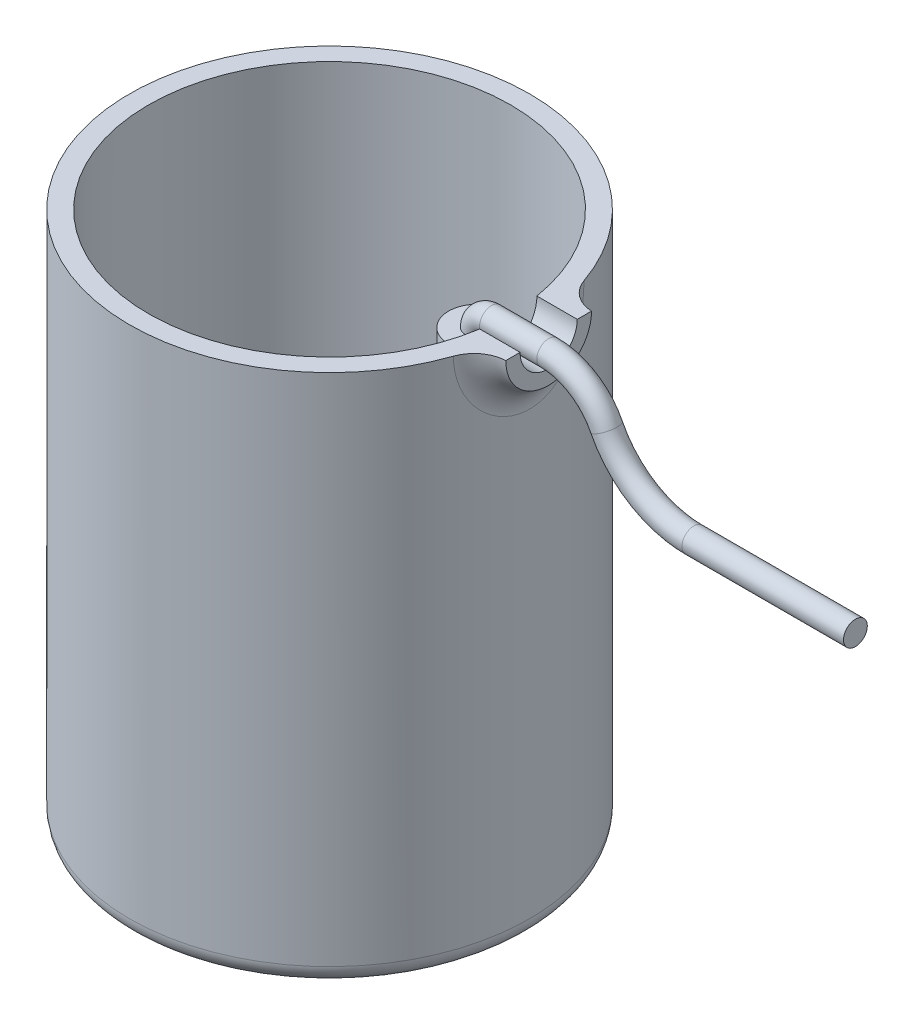
ISO-10303-21;
HEADER;
FILE_DESCRIPTION(('STEP AP214'),'2;1');
FILE_NAME('part.step','',(''),(''),'','','');
FILE_SCHEMA(('AUTOMOTIVE_DESIGN { 1 0 10303 214 1 1 1 1 }'));
ENDSEC;
DATA;
#1=APPLICATION_CONTEXT('core data for automotive mechanical design processes');
#2=APPLICATION_PROTOCOL_DEFINITION('international standard','automotive_design',2000,#1);
#3=PRODUCT_CONTEXT('',#1,'mechanical');
#4=PRODUCT('Part','Part','',(#3));
#5=PRODUCT_RELATED_PRODUCT_CATEGORY('part','',(#4));
#6=PRODUCT_DEFINITION_FORMATION('','',#4);
#7=PRODUCT_DEFINITION_CONTEXT('part definition',#1,'design');
#8=PRODUCT_DEFINITION('design','',#6,#7);
#9=PRODUCT_DEFINITION_SHAPE('','',#8);
#10=(LENGTH_UNIT() NAMED_UNIT(*) SI_UNIT(.MILLI.,.METRE.));
#11=(NAMED_UNIT(*) PLANE_ANGLE_UNIT() SI_UNIT($,.RADIAN.));
#12=(NAMED_UNIT(*) SI_UNIT($,.STERADIAN.) SOLID_ANGLE_UNIT());
#13=UNCERTAINTY_MEASURE_WITH_UNIT(LENGTH_MEASURE(1.E-05),#10,'distance_accuracy_value','');
#14=(GEOMETRIC_REPRESENTATION_CONTEXT(3) GLOBAL_UNCERTAINTY_ASSIGNED_CONTEXT((#13)) GLOBAL_UNIT_ASSIGNED_CONTEXT((#10,
#11,#12)) REPRESENTATION_CONTEXT('',''));
#15=CARTESIAN_POINT('',(0.,0.,0.));
#16=DIRECTION('',(0.,0.,1.));
#17=DIRECTION('',(1.,0.,0.));
#18=AXIS2_PLACEMENT_3D('',#15,#16,#17);
#19=CARTESIAN_POINT('',(0.,0.,0.));
#20=DIRECTION('',(0.,-1.,0.));
#21=DIRECTION('',(0.,0.,-1.));
#22=AXIS2_PLACEMENT_3D('',#19,#20,#21);
#23=CYLINDRICAL_SURFACE('',#22,21.);
#24=CARTESIAN_POINT('',(0.,2.,0.));
#25=DIRECTION('',(0.,-1.,0.));
#26=DIRECTION('',(0.,0.,-1.));
#27=AXIS2_PLACEMENT_3D('',#24,#25,#26);
#28=CIRCLE('',#27,21.);
#29=CARTESIAN_POINT('',(0.,2.,-21.));
#30=VERTEX_POINT('',#29);
#31=EDGE_CURVE('E120',#30,#30,#28,.F.);
#32=ORIENTED_EDGE('',*,*,#31,.T.);
#33=EDGE_LOOP('',(#32));
#34=FACE_BOUND('',#33,.T.);
#35=CARTESIAN_POINT('',(0.,56.,0.));
#36=DIRECTION('',(0.,-1.,0.));
#37=DIRECTION('',(0.,0.,-1.));
#38=AXIS2_PLACEMENT_3D('',#35,#36,#37);
#39=CIRCLE('',#38,21.);
#40=CARTESIAN_POINT('',(19.8499796078561,56.,6.85407248048206));
#41=VERTEX_POINT('',#40);
#42=CARTESIAN_POINT('',(19.8499796078561,56.,-6.854072480482));
#43=VERTEX_POINT('',#42);
#44=EDGE_CURVE('E110',#41,#43,#39,.T.);
#45=ORIENTED_EDGE('',*,*,#44,.T.);
#46=CARTESIAN_POINT('',(23.,58.2430537271344,3.90111650392407));
#47=CARTESIAN_POINT('',(20.7077864451711,58.7190716469949,4.01477908529431));
#48=CARTESIAN_POINT('',(20.1491447914273,59.9692255018648,5.91709085396675));
#49=CARTESIAN_POINT('',(23.,58.1402196181122,3.96025039395314));
#50=CARTESIAN_POINT('',(20.699960827176,58.5939635923719,4.07396738772159));
#51=CARTESIAN_POINT('',(20.1217707549883,59.7895840556157,6.0102744752983));
#52=CARTESIAN_POINT('',(23.,58.0350117850355,4.01532489795576));
#53=CARTESIAN_POINT('',(20.6925886550627,58.4660653326959,4.128900590115));
#54=CARTESIAN_POINT('',(20.0956272406185,59.6050949216455,6.09693835125919));
#55=CARTESIAN_POINT('',(23.,57.820455858703,4.11704064037203));
#56=CARTESIAN_POINT('',(20.6788529959362,58.2053402284517,4.23011824678415));
#57=CARTESIAN_POINT('',(20.0464448745531,59.2277917010188,6.25676742039932));
#58=CARTESIAN_POINT('',(23.,57.7111079244772,4.16368220231623));
#59=CARTESIAN_POINT('',(20.6724909470143,58.0725241354584,4.27639126825835));
#60=CARTESIAN_POINT('',(20.0234059037601,59.0349779340894,6.32993313143902));
#61=CARTESIAN_POINT('',(23.,57.4889696139641,4.24818463978836));
#62=CARTESIAN_POINT('',(20.6608913014349,57.8028593219275,4.36004727463155));
#63=CARTESIAN_POINT('',(19.9810928281289,58.6425560839005,6.46225515785594));
#64=CARTESIAN_POINT('',(23.,57.3761823788835,4.28605327122479));
#65=CARTESIAN_POINT('',(20.6556540720805,57.6660274374359,4.39742782519644));
#66=CARTESIAN_POINT('',(19.9618154002103,58.4429541822929,6.52142384860222));
#67=CARTESIAN_POINT('',(23.,57.1478049019924,4.35278277332633));
#68=CARTESIAN_POINT('',(20.6463827469605,57.3891159506213,4.46317931697273));
#69=CARTESIAN_POINT('',(19.9275079201361,58.0383375466153,6.62551058674562));
#70=CARTESIAN_POINT('',(23.,57.0322147461829,4.38164391998856));
#71=CARTESIAN_POINT('',(20.6423497886516,57.2490522469043,4.4915419713585));
#72=CARTESIAN_POINT('',(19.9124777378427,57.833322978603,6.6704290707821));
#73=CARTESIAN_POINT('',(23.,56.6856571235788,4.45363474283271));
#74=CARTESIAN_POINT('',(20.6322606467493,56.8292536508825,4.56222178811141));
#75=CARTESIAN_POINT('',(19.874770020463,57.2182985029501,6.78233146632502));
#76=CARTESIAN_POINT('',(23.,56.4514803462469,4.48346940859559));
#77=CARTESIAN_POINT('',(20.6280422984199,56.546009946086,4.59134788687038));
#78=CARTESIAN_POINT('',(19.8588061561282,56.8022490943829,6.82848618745863));
#79=CARTESIAN_POINT('',(23.,55.9813100598249,4.50611859298195));
#80=CARTESIAN_POINT('',(20.6248411348806,55.9773503519291,4.61348438890996));
#81=CARTESIAN_POINT('',(19.8467130598608,55.9667972936325,6.86354594123548));
#82=CARTESIAN_POINT('',(23.,55.7453169202398,4.49894045227436));
#83=CARTESIAN_POINT('',(20.6258590824167,55.6920946832333,4.60648951533922));
#84=CARTESIAN_POINT('',(19.8505798949482,55.5473955827772,6.85246232583209));
#85=CARTESIAN_POINT('',(23.,55.2777182819654,4.44787684659808));
#86=CARTESIAN_POINT('',(20.6330610908462,55.1263481608323,4.55652765267304));
#87=CARTESIAN_POINT('',(19.8777174499586,54.7167267959534,6.7733363689783));
#88=CARTESIAN_POINT('',(23.,55.0461133288163,4.40398684783002));
#89=CARTESIAN_POINT('',(20.6392418098724,54.8460121430399,4.51358388188284));
#90=CARTESIAN_POINT('',(19.9009905664953,54.3054607311335,6.70528699243414));
#91=CARTESIAN_POINT('',(23.,54.5933161997628,4.28092576302448));
#92=CARTESIAN_POINT('',(20.6563802291353,54.2971431472283,4.39244129628761));
#93=CARTESIAN_POINT('',(19.9645833919613,53.5028457806394,6.51348802427669));
#94=CARTESIAN_POINT('',(23.,54.3721251814166,4.2017507650808));
#95=CARTESIAN_POINT('',(20.66732986279,54.0287369666535,4.31430068856788));
#96=CARTESIAN_POINT('',(20.0049049909619,53.1114991087099,6.38973225670421));
#97=CARTESIAN_POINT('',(23.,53.9454370929978,4.01041413793367));
#98=CARTESIAN_POINT('',(20.6932956933603,53.5103581980699,4.12416508480508));
#99=CARTESIAN_POINT('',(20.0983782218066,52.360111567259,6.08931721705554));
#100=CARTESIAN_POINT('',(23.,53.7399287752306,3.89827643517762));
#101=CARTESIAN_POINT('',(20.7082978045027,53.260458596198,4.01228175367286));
#102=CARTESIAN_POINT('',(20.1515205425492,52.0000482350338,5.91269631619556));
#103=CARTESIAN_POINT('',(23.,53.348717231057,3.64351393206175));
#104=CARTESIAN_POINT('',(20.7413750441667,52.7846382692711,3.75643455120674));
#105=CARTESIAN_POINT('',(20.2650728454456,51.3208030925135,5.51091865375543));
#106=CARTESIAN_POINT('',(23.,53.1630098932833,3.50089547910738));
#107=CARTESIAN_POINT('',(20.7594381050177,52.558757060328,3.61258036468647));
#108=CARTESIAN_POINT('',(20.3254813133313,51.0016127927888,5.28577199724589));
#109=CARTESIAN_POINT('',(23.,52.8140478276441,3.18671757703731));
#110=CARTESIAN_POINT('',(20.7974163739112,52.1347370435086,3.29389462108461));
#111=CARTESIAN_POINT('',(20.4476573817046,50.410073533923,4.79148762003156));
#112=CARTESIAN_POINT('',(23.,52.6509386183428,3.01498508326401));
#113=CARTESIAN_POINT('',(20.8173336010592,51.9367732780899,3.11898313578324));
#114=CARTESIAN_POINT('',(20.5094310662796,50.1380255652803,4.52208718498042));
#115=CARTESIAN_POINT('',(23.,52.3523019850106,2.64587685905357));
#116=CARTESIAN_POINT('',(20.8571056061121,51.5750899733154,2.74131419252225));
#117=CARTESIAN_POINT('',(20.6276798496163,49.6485874824216,3.94774783979976));
#118=CARTESIAN_POINT('',(23.,52.2167941464121,2.44848308141868));
#119=CARTESIAN_POINT('',(20.8769583735801,51.411335900443,2.538620427649));
#120=CARTESIAN_POINT('',(20.6841511707071,49.4312361543769,3.64278393410216));
#121=CARTESIAN_POINT('',(23.,51.9736751219931,2.02491519533356));
#122=CARTESIAN_POINT('',(20.9148838063365,51.1183625039794,2.10219763617807));
#123=CARTESIAN_POINT('',(20.7879232576544,49.0482968259581,2.99552569937812));
#124=CARTESIAN_POINT('',(23.,51.8671331565807,1.79800584355142));
#125=CARTESIAN_POINT('',(20.9328868476712,50.9903285465868,1.86766467527896));
#126=CARTESIAN_POINT('',(20.8348595258176,48.8846556181867,2.65233107608471));
#127=CARTESIAN_POINT('',(23.,51.6927291540147,1.32674641484373));
#128=CARTESIAN_POINT('',(20.9635245330463,50.7813332311744,1.37949688381681));
#129=CARTESIAN_POINT('',(20.9125118621304,48.6206986819982,1.94734103946291));
#130=CARTESIAN_POINT('',(23.,51.6247908942242,1.08243178604691));
#131=CARTESIAN_POINT('',(20.9761888586377,50.7001288630425,1.12579495415456));
#132=CARTESIAN_POINT('',(20.9432598849266,48.5202581220954,1.58558382936695));
#133=CARTESIAN_POINT('',(23.,51.5687538883274,0.785167349994118));
#134=CARTESIAN_POINT('',(20.9867929385108,50.6332486581184,0.816718719205613));
#135=CARTESIAN_POINT('',(20.9686941450265,48.4379767405494,1.14846809242141));
#136=CARTESIAN_POINT('',(23.,51.5604427348931,0.736714231360254));
#137=CARTESIAN_POINT('',(20.9883723733996,50.6233370496814,0.766350506994567));
#138=CARTESIAN_POINT('',(20.9724697476755,48.4257988595753,1.07731374235106));
#139=CARTESIAN_POINT('',(23.,51.5454003195381,0.639502403999762));
#140=CARTESIAN_POINT('',(20.9912425953013,50.6054031087628,0.665280880398418));
#141=CARTESIAN_POINT('',(20.9793094097851,48.4037979098955,0.934706516850487));
#142=CARTESIAN_POINT('',(23.,51.5386690119842,0.590743704141491));
#143=CARTESIAN_POINT('',(20.9925334960028,50.5973800476633,0.61457769873566));
#144=CARTESIAN_POINT('',(20.9823734897977,48.3939747731739,0.863253650103471));
#145=CARTESIAN_POINT('',(23.,51.4993601037629,0.266500502549364));
#146=CARTESIAN_POINT('',(21.0000778684083,50.5505543364071,0.277473598974685));
#147=CARTESIAN_POINT('',(21.000271628332,48.3366433075221,0.388517292184877));
#148=CARTESIAN_POINT('',(23.,51.4914544979026,-0.0132305420824088));
#149=CARTESIAN_POINT('',(21.0016494149226,50.5411430238479,-0.013868963337211));
#150=CARTESIAN_POINT('',(21.0038972136282,48.3252914164423,-0.0190346611935832));
#151=CARTESIAN_POINT('',(23.,51.5273933259894,-0.568926637889749));
#152=CARTESIAN_POINT('',(20.9946909981463,50.5839435521437,-0.591992221645163));
#153=CARTESIAN_POINT('',(20.9875025513202,48.3775063435663,-0.830876366881333));
#154=CARTESIAN_POINT('',(23.,51.5713753755302,-0.844879701939849));
#155=CARTESIAN_POINT('',(20.9861250418558,50.6363751934542,-0.879135558970664));
#156=CARTESIAN_POINT('',(20.9674194237605,48.441272387677,-1.2351545680676));
#157=CARTESIAN_POINT('',(23.,51.7080531830557,-1.38034706934117));
#158=CARTESIAN_POINT('',(20.9608607645302,50.7996641845041,-1.43507413014874));
#159=CARTESIAN_POINT('',(20.9057059195354,48.6439645721177,-2.02695763726325));
#160=CARTESIAN_POINT('',(23.,51.8006171806654,-1.63990371899816));
#161=CARTESIAN_POINT('',(20.944158827049,50.9105384682163,-1.70416561135896));
#162=CARTESIAN_POINT('',(20.8641338282422,48.7826874499377,-2.41452476610798));
#163=CARTESIAN_POINT('',(23.,52.0289541204288,-2.13423124924901));
#164=CARTESIAN_POINT('',(20.9060037577122,51.1848752836381,-2.21508374606002));
#165=CARTESIAN_POINT('',(20.7640965907372,49.134558756018,-3.16135473268947));
#166=CARTESIAN_POINT('',(23.,52.1646848317498,-2.36902605712679));
#167=CARTESIAN_POINT('',(20.884535014431,51.3484752037218,-2.45699544172153));
#168=CARTESIAN_POINT('',(20.7056479602963,49.3476344631886,-3.5206448076428));
#169=CARTESIAN_POINT('',(23.,52.4671782307686,-2.79921040357287));
#170=CARTESIAN_POINT('',(20.8412278428969,51.7140919155062,-2.89854503978659));
#171=CARTESIAN_POINT('',(20.581375862021,49.8352899629665,-4.18531628661238));
#172=CARTESIAN_POINT('',(23.,52.6324792769761,-2.99580205145492));
#173=CARTESIAN_POINT('',(20.8194337092222,51.9144310543254,-3.09943198678026));
#174=CARTESIAN_POINT('',(20.5159418242276,50.1070626834083,-4.49228108914278));
#175=CARTESIAN_POINT('',(23.,52.9924128663399,-3.35699259505796));
#176=CARTESIAN_POINT('',(20.7772185895855,52.3513974555132,-3.4669694438368));
#177=CARTESIAN_POINT('',(20.3836262211947,50.7107377324507,-5.05891431482494));
#178=CARTESIAN_POINT('',(23.,53.187041364781,-3.52159589531665));
#179=CARTESIAN_POINT('',(20.7568064142911,52.5880453841923,-3.63349389042029));
#180=CARTESIAN_POINT('',(20.3167448566517,51.0426317706537,-5.31858924910029));
#181=CARTESIAN_POINT('',(23.,53.5896307951743,-3.80759446701762));
#182=CARTESIAN_POINT('',(20.7202437432722,53.0776648003119,-3.92147201386236));
#183=CARTESIAN_POINT('',(20.193130358981,51.7379688091022,-5.76969964146656));
#184=CARTESIAN_POINT('',(23.,53.7963104498291,-3.93083838084211));
#185=CARTESIAN_POINT('',(20.7039335800025,53.3290601405065,-4.04476550615741));
#186=CARTESIAN_POINT('',(20.1360447789902,52.0987525486004,-5.96405553611615));
#187=CARTESIAN_POINT('',(23.,54.2271575258129,-4.14302024407058));
#188=CARTESIAN_POINT('',(20.6753790956784,53.8527051038432,-4.25612564624896));
#189=CARTESIAN_POINT('',(20.0342145390462,52.8555784909476,-6.29768439890945));
#190=CARTESIAN_POINT('',(23.,54.4513203131648,-4.23196724711172));
#191=CARTESIAN_POINT('',(20.6631460671958,54.1248664353467,-4.34410231753701));
#192=CARTESIAN_POINT('',(19.9894666231086,53.2516113547726,-6.43697190415442));
#193=CARTESIAN_POINT('',(23.,54.9061008485544,-4.37133508282617));
#194=CARTESIAN_POINT('',(20.6438155825137,54.6763959171989,-4.48153224089083));
#195=CARTESIAN_POINT('',(19.9180881890148,54.0570304154953,-6.65451672636407));
#196=CARTESIAN_POINT('',(23.,55.1364236042026,-4.42265089808514));
#197=CARTESIAN_POINT('',(20.6366082897622,54.9553082764888,-4.5318133570114));
#198=CARTESIAN_POINT('',(19.8910385657267,54.4658474316669,-6.73419278583286));
#199=CARTESIAN_POINT('',(23.,55.6029800106329,-4.48862828726342));
#200=CARTESIAN_POINT('',(20.6273188182151,55.5199564773833,-4.59642599262685));
#201=CARTESIAN_POINT('',(19.8561094667656,55.2944753641475,-6.83651918277932));
#202=CARTESIAN_POINT('',(23.,55.8392146459501,-4.50328371435937));
#203=CARTESIAN_POINT('',(20.6252425866498,55.8055425065914,-4.61071594551506));
#204=CARTESIAN_POINT('',(19.8482332058837,55.7142881121816,-6.85915995719246));
#205=CARTESIAN_POINT('',(23.,56.1924936013786,-4.49742720884454));
#206=CARTESIAN_POINT('',(20.626069370709,56.2327917787783,-4.60498615678929));
#207=CARTESIAN_POINT('',(19.8513501629403,56.3420568028355,-6.8500882733794));
#208=CARTESIAN_POINT('',(23.,56.309976306964,-4.490852254342));
#209=CARTESIAN_POINT('',(20.6269993398294,56.3748678690042,-4.59856588452309));
#210=CARTESIAN_POINT('',(19.8548685125941,56.5508136404277,-6.83991876040134));
#211=CARTESIAN_POINT('',(23.,56.5440086749567,-4.46854000464633));
#212=CARTESIAN_POINT('',(20.6301479951449,56.6579907903603,-4.57674439736237));
#213=CARTESIAN_POINT('',(19.8667421438505,56.9665892284786,-6.80536052799239));
#214=CARTESIAN_POINT('',(23.,56.6605583324329,-4.45280266106391));
#215=CARTESIAN_POINT('',(20.6323662537467,56.7990182962038,-4.56134615398009));
#216=CARTESIAN_POINT('',(19.8750974509987,57.1736079697522,-6.78097173346527));
#217=CARTESIAN_POINT('',(23.,56.8919862692314,-4.41227518794661));
#218=CARTESIAN_POINT('',(20.6380603876445,57.0792012189651,-4.52161697780793));
#219=CARTESIAN_POINT('',(19.8964538412496,57.5844968115868,-6.71805444784956));
#220=CARTESIAN_POINT('',(23.,57.0068633893226,-4.38747906394684));
#221=CARTESIAN_POINT('',(20.6415363356483,57.2183373457408,-4.49728548103613));
#222=CARTESIAN_POINT('',(19.9094580005136,57.7883647338329,-6.67951659382262));
#223=CARTESIAN_POINT('',(23.,57.2341626093718,-4.32904561484516));
#224=CARTESIAN_POINT('',(20.6496858452885,57.4938035853855,-4.43980395849624));
#225=CARTESIAN_POINT('',(19.9397515366175,58.19139282432,-6.58850885257542));
#226=CARTESIAN_POINT('',(23.,57.3465845587621,-4.29540774914749));
#227=CARTESIAN_POINT('',(20.6543584512886,57.6301174931816,-4.40666081126394));
#228=CARTESIAN_POINT('',(19.9570411754735,58.3905527038932,-6.53603811347819));
#229=CARTESIAN_POINT('',(23.,57.4574195129223,-4.2574556208319));
#230=CARTESIAN_POINT('',(20.6596007141805,57.7646434010658,-4.36915994244337));
#231=CARTESIAN_POINT('',(19.9762929087104,58.5866366601394,-6.47670607835557));
#232=(BOUNDED_SURFACE() B_SPLINE_SURFACE(3,2,((#46,#47,#48),(#49,#50,#51),(#52,#53,#54),(#55,
#56,#57),(#58,#59,#60),(#61,#62,#63),(#64,#65,#66),(#67,#68,#69),(#70,#71,#72),(#73,#74,#75),
(#76,#77,#78),(#79,#80,#81),(#82,#83,#84),(#85,#86,#87),(#88,#89,#90),(#91,#92,#93),(#94,#95,
#96),(#97,#98,#99),(#100,#101,#102),(#103,#104,#105),(#106,#107,#108),(#109,#110,#111),(#112,
#113,#114),(#115,#116,#117),(#118,#119,#120),(#121,#122,#123),(#124,#125,#126),(#127,#128,#129),
(#130,#131,#132),(#133,#134,#135),(#136,#137,#138),(#139,#140,#141),(#142,#143,#144),(#145,#146,
#147),(#148,#149,#150),(#151,#152,#153),(#154,#155,#156),(#157,#158,#159),(#160,#161,#162),
(#163,#164,#165),(#166,#167,#168),(#169,#170,#171),(#172,#173,#174),(#175,#176,#177),(#178,#179,
#180),(#181,#182,#183),(#184,#185,#186),(#187,#188,#189),(#190,#191,#192),(#193,#194,#195),
(#196,#197,#198),(#199,#200,#201),(#202,#203,#204),(#205,#206,#207),(#208,#209,#210),(#211,#212,
#213),(#214,#215,#216),(#217,#218,#219),(#220,#221,#222),(#223,#224,#225),(#226,#227,#228),
(#229,#230,#231)),.UNSPECIFIED.,.F.,.F.,.F.) B_SPLINE_SURFACE_WITH_KNOTS((4,2,2,2,2,2,2,2,2,2,2,
2,2,2,2,2,2,2,2,2,2,2,2,2,2,2,2,2,2,2,4),(3,3),(0.,0.636961694353386,1.27389894642835,
1.91027093230247,2.54662341727417,3.79993314360261,5.05299431331709,6.30621025500942,
7.55956517029888,8.81201255724594,10.0641993843717,11.3241079678035,12.584907468789,
13.8873497232146,15.1872113013645,15.439248639138,15.6912786960274,17.1104977347292,
18.5334892805521,19.9526412860174,21.3704091565121,22.7313582627845,24.0921198443536,
25.3796465754021,26.666833194381,27.9223148408125,29.1780069789267,29.8048022292798,
30.4316007899544,31.0588148754259,31.6860673185178),(0.,1.),
.UNSPECIFIED.) GEOMETRIC_REPRESENTATION_ITEM() RATIONAL_B_SPLINE_SURFACE(((1.,0.830893335376098,
1.),(1.,0.830549178015659,1.),(1.,0.830225751135677,1.),(1.,0.829623909157339,1.),(1.,
0.829345492332211,1.),(1.,0.82883741987927,1.),(1.,0.828607721196373,1.),(1.,0.82820036522587,
1.),(1.,0.828022706343729,1.),(1.,0.827577534227736,1.),(1.,0.827389899562165,1.),(1.,
0.827247755939217,1.),(1.,0.827293200755686,1.),(1.,0.827612494933342,1.),(1.,0.827886372505246,
1.),(1.,0.828639974284975,1.),(1.,0.829119721316502,1.),(1.,0.830256770454492,1.),(1.,
0.830913943745475,1.),(1.,0.832379639222017,1.),(1.,0.833188129892429,1.),(1.,0.834925815113029,
1.),(1.,0.835855723253183,1.),(1.,0.837761750710435,1.),(1.,0.838737902239801,1.),(1.,
0.840646585915399,1.),(1.,0.841576612475407,1.),(1.,0.843185188190249,1.),(1.,0.843864231974451,
1.),(1.,0.84443664392475,1.),(1.,0.844522103065747,1.),(1.,0.844677649105141,1.),(1.,
0.844747736447542,1.),(1.,0.845157744639957,1.),(1.,0.845244103159933,1.),(1.,0.844864840051907,
1.),(1.,0.844397750563781,1.),(1.,0.843045461651162,1.),(1.,0.842161393778705,1.),(1.,
0.840194580258959,1.),(1.,0.839112029228123,1.),(1.,0.836992095119325,1.),(1.,0.835954640569071,
1.),(1.,0.833994005944535,1.),(1.,0.833070810144109,1.),(1.,0.831440005638506,1.),(1.,
0.830723468272056,1.),(1.,0.829471825218925,1.),(1.,0.828936671655393,1.),(1.,0.828088052928473,
1.),(1.,0.827769451986036,1.),(1.,0.82735819674703,1.),(1.,0.827265580341205,1.),(1.,
0.827302247505458,1.),(1.,0.827343627063694,1.),(1.,0.827483367530061,1.),(1.,0.82758172873913,
1.),(1.,0.82783346795137,1.),(1.,0.827986882383704,1.),(1.,0.828345616602563,1.),(1.,
0.828550939562813,1.),(1.,0.828780656677998,1.))) REPRESENTATION_ITEM('') SURFACE());
#233=CARTESIAN_POINT('',(19.9762929087104,58.5866366601394,-6.47670607835557));
#234=CARTESIAN_POINT('',(19.9570411754735,58.3905527038932,-6.53603811347819));
#235=CARTESIAN_POINT('',(19.9397515366175,58.19139282432,-6.58850885257542));
#236=CARTESIAN_POINT('',(19.9094580005136,57.7883647338329,-6.67951659382262));
#237=CARTESIAN_POINT('',(19.8964538412495,57.5844968115868,-6.71805444784956));
#238=CARTESIAN_POINT('',(19.8750974509987,57.1736079697522,-6.78097173346527));
#239=CARTESIAN_POINT('',(19.8667421438505,56.9665892284786,-6.80536052799239));
#240=CARTESIAN_POINT('',(19.8548685125941,56.5508136404277,-6.83991876040134));
#241=CARTESIAN_POINT('',(19.8513501629403,56.3420568028355,-6.8500882733794));
#242=CARTESIAN_POINT('',(19.8482332058837,55.7142881121816,-6.85915995719246));
#243=CARTESIAN_POINT('',(19.8561094667656,55.2944753641475,-6.83651918277932));
#244=CARTESIAN_POINT('',(19.8910385657267,54.4658474316669,-6.73419278583286));
#245=CARTESIAN_POINT('',(19.9180881890148,54.0570304154953,-6.65451672636407));
#246=CARTESIAN_POINT('',(19.9894666231086,53.2516113547726,-6.43697190415442));
#247=CARTESIAN_POINT('',(20.0342145390462,52.8555784909476,-6.29768439890945));
#248=CARTESIAN_POINT('',(20.1360447789902,52.0987525486004,-5.96405553611615));
#249=CARTESIAN_POINT('',(20.193130358981,51.7379688091022,-5.76969964146656));
#250=CARTESIAN_POINT('',(20.3167448566517,51.0426317706537,-5.31858924910029));
#251=CARTESIAN_POINT('',(20.3836262211947,50.7107377324507,-5.05891431482494));
#252=CARTESIAN_POINT('',(20.5159418242276,50.1070626834083,-4.49228108914278));
#253=CARTESIAN_POINT('',(20.581375862021,49.8352899629665,-4.18531628661238));
#254=CARTESIAN_POINT('',(20.7056479602963,49.3476344631886,-3.5206448076428));
#255=CARTESIAN_POINT('',(20.7640965907372,49.1345587560181,-3.16135473268947));
#256=CARTESIAN_POINT('',(20.8641338282422,48.7826874499377,-2.41452476610798));
#257=CARTESIAN_POINT('',(20.9057059195354,48.6439645721177,-2.02695763726325));
#258=CARTESIAN_POINT('',(20.9674194237605,48.441272387677,-1.2351545680676));
#259=CARTESIAN_POINT('',(20.9875025513202,48.3775063435663,-0.830876366881332));
#260=CARTESIAN_POINT('',(21.0038972136282,48.3252914164423,-0.0190346611935833));
#261=CARTESIAN_POINT('',(21.000271628332,48.3366433075221,0.388517292184876));
#262=CARTESIAN_POINT('',(20.9823734897977,48.3939747731739,0.863253650103471));
#263=CARTESIAN_POINT('',(20.9793094097851,48.4037979098955,0.934706516850486));
#264=CARTESIAN_POINT('',(20.9724697476755,48.4257988595753,1.07731374235106));
#265=CARTESIAN_POINT('',(20.9686941450266,48.4379767405495,1.14846809242141));
#266=CARTESIAN_POINT('',(20.9432598849266,48.5202581220954,1.58558382936695));
#267=CARTESIAN_POINT('',(20.9125118621304,48.6206986819982,1.94734103946291));
#268=CARTESIAN_POINT('',(20.8348595258176,48.8846556181867,2.65233107608471));
#269=CARTESIAN_POINT('',(20.7879232576544,49.0482968259581,2.99552569937812));
#270=CARTESIAN_POINT('',(20.6841511707071,49.4312361543769,3.64278393410216));
#271=CARTESIAN_POINT('',(20.6276798496163,49.6485874824216,3.94774783979976));
#272=CARTESIAN_POINT('',(20.5094310662796,50.1380255652803,4.52208718498042));
#273=CARTESIAN_POINT('',(20.4476573817046,50.410073533923,4.79148762003156));
#274=CARTESIAN_POINT('',(20.3254813133313,51.0016127927888,5.28577199724589));
#275=CARTESIAN_POINT('',(20.2650728454456,51.3208030925136,5.51091865375543));
#276=CARTESIAN_POINT('',(20.1515205425492,52.0000482350338,5.91269631619556));
#277=CARTESIAN_POINT('',(20.0983782218066,52.360111567259,6.08931721705554));
#278=CARTESIAN_POINT('',(20.0049049909619,53.1114991087099,6.38973225670421));
#279=CARTESIAN_POINT('',(19.9645833919613,53.5028457806394,6.51348802427669));
#280=CARTESIAN_POINT('',(19.9009905664953,54.3054607311335,6.70528699243414));
#281=CARTESIAN_POINT('',(19.8777174499586,54.7167267959534,6.7733363689783));
#282=CARTESIAN_POINT('',(19.8505798949482,55.5473955827772,6.85246232583209));
#283=CARTESIAN_POINT('',(19.8467130598608,55.9667972936325,6.86354594123548));
#284=CARTESIAN_POINT('',(19.8588061561282,56.8022490943828,6.82848618745863));
#285=CARTESIAN_POINT('',(19.874770020463,57.2182985029501,6.78233146632502));
#286=CARTESIAN_POINT('',(19.9124777378427,57.833322978603,6.6704290707821));
#287=CARTESIAN_POINT('',(19.9275079201361,58.0383375466153,6.62551058674562));
#288=CARTESIAN_POINT('',(19.9618154002103,58.4429541822929,6.52142384860222));
#289=CARTESIAN_POINT('',(19.9810928281289,58.6425560839005,6.46225515785594));
#290=CARTESIAN_POINT('',(20.0234059037601,59.0349779340894,6.32993313143902));
#291=CARTESIAN_POINT('',(20.0464448745531,59.2277917010188,6.25676742039932));
#292=CARTESIAN_POINT('',(20.0956272406185,59.6050949216455,6.09693835125919));
#293=CARTESIAN_POINT('',(20.1217707549883,59.7895840556157,6.0102744752983));
#294=CARTESIAN_POINT('',(20.1491447914273,59.9692255018648,5.91709085396675));
#295=B_SPLINE_CURVE_WITH_KNOTS('',3,(#233,#234,#235,#236,#237,#238,#239,#240,#241,#242,#243,
#244,#245,#246,#247,#248,#249,#250,#251,#252,#253,#254,#255,#256,#257,#258,#259,#260,#261,#262,
#263,#264,#265,#266,#267,#268,#269,#270,#271,#272,#273,#274,#275,#276,#277,#278,#279,#280,#281,
#282,#283,#284,#285,#286,#287,#288,#289,#290,#291,#292,#293,#294),.UNSPECIFIED.,.F.,.F.,(4,2,2,
2,2,2,2,2,2,2,2,2,2,2,2,2,2,2,2,2,2,2,2,2,2,2,2,2,2,2,4),(0.,0.627252443091877,1.25446652856341,
1.88126508923797,2.50806033959105,3.76375247770533,5.01923412413676,6.30642074311567,
7.59394747416419,8.9547090557333,10.3156581620057,11.7334260325004,13.1525780379657,
14.5755695837886,15.9947886224904,16.2468186793798,16.4988560171533,17.7987175953032,
19.1011598497287,20.3619593507143,21.6218679341461,22.8740547612718,24.1265021482189,
25.3798570635084,26.6330730052007,27.8861341749152,29.1394439012436,29.7757963862153,
30.4121683720894,31.0491056241644,31.6860673185178),.UNSPECIFIED.);
#296=EDGE_CURVE('E124',#43,#41,#295,.T.);
#297=ORIENTED_EDGE('',*,*,#296,.T.);
#298=EDGE_LOOP('',(#45,#297));
#299=FACE_BOUND('',#298,.T.);
#300=ADVANCED_FACE('F41',(#34,#299),#23,.T.);
#301=CARTESIAN_POINT('',(0.,2.,0.));
#302=DIRECTION('',(0.,1.,0.));
#303=DIRECTION('',(0.,0.,1.));
#304=AXIS2_PLACEMENT_3D('',#301,#302,#303);
#305=PLANE('',#304);
#306=CARTESIAN_POINT('',(15.5,2.,0.));
#307=DIRECTION('',(0.,1.,0.));
#308=DIRECTION('',(0.,0.,1.));
#309=AXIS2_PLACEMENT_3D('',#306,#307,#308);
#310=CIRCLE('',#309,3.);
#311=CARTESIAN_POINT('',(15.5,2.,3.));
#312=VERTEX_POINT('',#311);
#313=EDGE_CURVE('E303',#312,#312,#310,.T.);
#314=ORIENTED_EDGE('',*,*,#313,.F.);
#315=EDGE_LOOP('',(#314));
#316=FACE_BOUND('',#315,.T.);
#317=CARTESIAN_POINT('',(0.,2.,0.));
#318=DIRECTION('',(0.,-1.,0.));
#319=DIRECTION('',(0.,0.,-1.));
#320=AXIS2_PLACEMENT_3D('',#317,#318,#319);
#321=CIRCLE('',#320,19.);
#322=CARTESIAN_POINT('',(0.,2.,-19.));
#323=VERTEX_POINT('',#322);
#324=EDGE_CURVE('E109',#323,#323,#321,.T.);
#325=ORIENTED_EDGE('',*,*,#324,.F.);
#326=EDGE_LOOP('',(#325));
#327=FACE_BOUND('',#326,.T.);
#328=ADVANCED_FACE('F139',(#316,#327),#305,.T.);
#329=CARTESIAN_POINT('',(0.,0.,0.));
#330=DIRECTION('',(0.,-1.,0.));
#331=DIRECTION('',(0.,0.,-1.));
#332=AXIS2_PLACEMENT_3D('',#329,#330,#331);
#333=CYLINDRICAL_SURFACE('',#332,19.);
#334=CARTESIAN_POINT('',(18.7616630392938,56.,3.00000000000006));
#335=CARTESIAN_POINT('',(18.761657423998,55.9161825604073,3.00000869502199));
#336=CARTESIAN_POINT('',(18.7622245982653,55.8323696771555,2.99648739376207));
#337=CARTESIAN_POINT('',(18.7644629923588,55.6653539891527,2.98245218505682));
#338=CARTESIAN_POINT('',(18.7661341076854,55.5821511274105,2.97193893947116));
#339=CARTESIAN_POINT('',(18.7705361931051,55.4170405718178,2.94400415988912));
#340=CARTESIAN_POINT('',(18.7732658749571,55.3351314291674,2.92659102227858));
#341=CARTESIAN_POINT('',(18.7797012860914,55.1731103478566,2.88500578102272));
#342=CARTESIAN_POINT('',(18.7834070132543,55.0929984052938,2.86083369205504));
#343=CARTESIAN_POINT('',(18.7958404034488,54.8561636732071,2.77840235185322));
#344=CARTESIAN_POINT('',(18.8058873473559,54.7028343969563,2.71020970070203));
#345=CARTESIAN_POINT('',(18.8283581111186,54.4098777359918,2.54940708876379));
#346=CARTESIAN_POINT('',(18.8407819114043,54.2702502384775,2.45679732901477));
#347=CARTESIAN_POINT('',(18.8667293195783,54.0073305997955,2.24890102453054));
#348=CARTESIAN_POINT('',(18.8802607659226,53.8841746927487,2.13344286443401));
#349=CARTESIAN_POINT('',(18.9068301208734,53.6588938853749,1.8834915766065));
#350=CARTESIAN_POINT('',(18.9198679537061,53.556772203378,1.74899554129953));
#351=CARTESIAN_POINT('',(18.9440630322152,53.3759533603581,1.4639051001426));
#352=CARTESIAN_POINT('',(18.9552099031092,53.2973837209021,1.31322884984651));
#353=CARTESIAN_POINT('',(18.9742785910654,53.1667245338713,1.00062131516932));
#354=CARTESIAN_POINT('',(18.9822007815931,53.1146319196928,0.83869133668041));
#355=CARTESIAN_POINT('',(18.9938725255218,53.0388183521606,0.509588402360056));
#356=CARTESIAN_POINT('',(18.9976561038329,53.0148659261869,0.342469996530485));
#357=CARTESIAN_POINT('',(19.0007411053238,52.99529346957,0.00654223245910571));
#358=CARTESIAN_POINT('',(19.0000426964357,52.9996723774024,-0.162267062191508));
#359=CARTESIAN_POINT('',(18.9942693178939,53.0364575992912,-0.495195123577505));
#360=CARTESIAN_POINT('',(18.9892333610298,53.0686140836583,-0.659342266961186));
#361=CARTESIAN_POINT('',(18.9753942524631,53.159648757764,-0.979880162242109));
#362=CARTESIAN_POINT('',(18.9665910186346,53.2185275300441,-1.13627074496512));
#363=CARTESIAN_POINT('',(18.9461395429066,53.3615888432726,-1.43760997717451));
#364=CARTESIAN_POINT('',(18.9344795785375,53.4458759833158,-1.58250813977246));
#365=CARTESIAN_POINT('',(18.9096129160728,53.6372818672341,-1.85619267268496));
#366=CARTESIAN_POINT('',(18.8964061646893,53.7444013978043,-1.98497848760226));
#367=CARTESIAN_POINT('',(18.8697482716008,53.9798037236421,-2.2242472603209));
#368=CARTESIAN_POINT('',(18.8562960297529,54.1083020463587,-2.33451813106773));
#369=CARTESIAN_POINT('',(18.8307975969792,54.3821358716989,-2.53199745921606));
#370=CARTESIAN_POINT('',(18.8187518109854,54.5274761994154,-2.61919928392261));
#371=CARTESIAN_POINT('',(18.7974283233195,54.831121155361,-2.76809987118403));
#372=CARTESIAN_POINT('',(18.7881548051623,54.9894449221699,-2.82976014356903));
#373=CARTESIAN_POINT('',(18.7734929089433,55.3142710955122,-2.92546538419847));
#374=CARTESIAN_POINT('',(18.7680987156028,55.4807608589359,-2.95955169663896));
#375=CARTESIAN_POINT('',(18.7638576155871,55.707084244195,-2.98624689727119));
#376=CARTESIAN_POINT('',(18.763035347921,55.7655973407484,-2.99140653790588));
#377=CARTESIAN_POINT('',(18.7619386344572,55.8827318227603,-2.99827856784788));
#378=CARTESIAN_POINT('',(18.7616632674623,55.9413528593666,-2.9999967539685));
#379=CARTESIAN_POINT('',(18.7616630392938,56.,-2.99999999999998));
#380=B_SPLINE_CURVE_WITH_KNOTS('',3,(#334,#335,#336,#337,#338,#339,#340,#341,#342,#343,#344,
#345,#346,#347,#348,#349,#350,#351,#352,#353,#354,#355,#356,#357,#358,#359,#360,#361,#362,#363,
#364,#365,#366,#367,#368,#369,#370,#371,#372,#373,#374,#375,#376,#377,#378,#379),.UNSPECIFIED.,
.F.,.F.,(4,2,2,2,2,2,2,2,2,2,2,2,2,2,2,2,2,2,2,2,2,2,4),(0.,0.251368417545015,0.502713043862161,
0.75375274698466,1.00479190495728,1.50654681734498,2.00829759866742,2.51397079978335,
3.01972131377177,3.52816268515553,4.03654515476631,4.54071587685655,5.04486770868393,
5.54453189105396,6.04420696654676,6.54596782610203,7.04774597673566,7.55492892186476,
8.06225753156412,8.5703479094529,9.07767504084724,9.25383551157095,9.42969900582079),.UNSPECIFIED.);
#381=CARTESIAN_POINT('',(18.7616630392938,56.,3.00000000000006));
#382=VERTEX_POINT('',#381);
#383=CARTESIAN_POINT('',(18.7616630392938,56.,-2.99999999999998));
#384=VERTEX_POINT('',#383);
#385=EDGE_CURVE('E92',#382,#384,#380,.T.);
#386=ORIENTED_EDGE('',*,*,#385,.T.);
#387=CARTESIAN_POINT('',(0.,56.,0.));
#388=DIRECTION('',(0.,-1.,0.));
#389=DIRECTION('',(0.,0.,-1.));
#390=AXIS2_PLACEMENT_3D('',#387,#388,#389);
#391=CIRCLE('',#390,19.);
#392=EDGE_CURVE('E103',#382,#384,#391,.T.);
#393=ORIENTED_EDGE('',*,*,#392,.F.);
#394=EDGE_LOOP('',(#386,#393));
#395=FACE_BOUND('',#394,.T.);
#396=ORIENTED_EDGE('',*,*,#324,.T.);
#397=EDGE_LOOP('',(#396));
#398=FACE_BOUND('',#397,.T.);
#399=ADVANCED_FACE('F101',(#395,#398),#333,.F.);
#400=CARTESIAN_POINT('',(19.0000000000001,56.,0.));
#401=DIRECTION('',(0.,1.,0.));
#402=DIRECTION('',(0.,0.,1.));
#403=AXIS2_PLACEMENT_3D('',#400,#401,#402);
#404=PLANE('',#403);
#405=DIRECTION('',(-1.,0.,0.));
#406=VECTOR('',#405,1.);
#407=CARTESIAN_POINT('',(19.0000000000001,56.,2.99999999999995));
#408=LINE('',#407,#406);
#409=CARTESIAN_POINT('',(23.0000000000001,56.,3.00000000000003));
#410=VERTEX_POINT('',#409);
#411=EDGE_CURVE('E108',#410,#382,#408,.T.);
#412=ORIENTED_EDGE('',*,*,#411,.T.);
#413=ORIENTED_EDGE('',*,*,#392,.T.);
#414=DIRECTION('',(-1.,0.,0.));
#415=VECTOR('',#414,1.);
#416=CARTESIAN_POINT('',(19.,56.,-3.));
#417=LINE('',#416,#415);
#418=CARTESIAN_POINT('',(23.0000000000001,56.,-3.00000000000003));
#419=VERTEX_POINT('',#418);
#420=EDGE_CURVE('E88',#419,#384,#417,.T.);
#421=ORIENTED_EDGE('',*,*,#420,.F.);
#422=DIRECTION('',(0.,0.,1.));
#423=VECTOR('',#422,1.);
#424=CARTESIAN_POINT('',(23.0000000000001,56.,-3.00000000000003));
#425=LINE('',#424,#423);
#426=CARTESIAN_POINT('',(23.0000000000001,56.,-4.50000000000003));
#427=VERTEX_POINT('',#426);
#428=EDGE_CURVE('E98',#427,#419,#425,.T.);
#429=ORIENTED_EDGE('',*,*,#428,.F.);
#430=CARTESIAN_POINT('',(23.1583095424988,56.,-7.99641789389569));
#431=DIRECTION('',(0.,1.,0.));
#432=DIRECTION('',(0.,0.,1.));
#433=AXIS2_PLACEMENT_3D('',#430,#431,#432);
#434=CIRCLE('',#433,3.5);
#435=EDGE_CURVE('E11',#427,#43,#434,.F.);
#436=ORIENTED_EDGE('',*,*,#435,.T.);
#437=ORIENTED_EDGE('',*,*,#44,.F.);
#438=CARTESIAN_POINT('',(23.1583095424988,56.,7.99641789389563));
#439=DIRECTION('',(0.,1.,0.));
#440=DIRECTION('',(0.,0.,1.));
#441=AXIS2_PLACEMENT_3D('',#438,#439,#440);
#442=CIRCLE('',#441,3.5);
#443=CARTESIAN_POINT('',(23.0000000000001,56.,4.50000000000003));
#444=VERTEX_POINT('',#443);
#445=EDGE_CURVE('E54',#41,#444,#442,.F.);
#446=ORIENTED_EDGE('',*,*,#445,.T.);
#447=DIRECTION('',(0.,0.,-1.));
#448=VECTOR('',#447,1.);
#449=CARTESIAN_POINT('',(23.0000000000001,56.,3.00000000000003));
#450=LINE('',#449,#448);
#451=EDGE_CURVE('E97',#444,#410,#450,.T.);
#452=ORIENTED_EDGE('',*,*,#451,.T.);
#453=EDGE_LOOP('',(#412,#413,#421,#429,#436,#437,#446,#452));
#454=FACE_BOUND('',#453,.T.);
#455=ADVANCED_FACE('F106',(#454),#404,.T.);
#456=CARTESIAN_POINT('',(21.0000000000001,0.,0.));
#457=DIRECTION('',(0.,-1.,0.));
#458=DIRECTION('',(0.,0.,-1.));
#459=AXIS2_PLACEMENT_3D('',#456,#457,#458);
#460=PLANE('',#459);
#461=CARTESIAN_POINT('',(0.,0.,0.));
#462=DIRECTION('',(0.,-1.,0.));
#463=DIRECTION('',(0.,0.,-1.));
#464=AXIS2_PLACEMENT_3D('',#461,#462,#463);
#465=CIRCLE('',#464,19.);
#466=CARTESIAN_POINT('',(0.,0.,-19.));
#467=VERTEX_POINT('',#466);
#468=EDGE_CURVE('E113',#467,#467,#465,.T.);
#469=ORIENTED_EDGE('',*,*,#468,.T.);
#470=EDGE_LOOP('',(#469));
#471=FACE_BOUND('',#470,.T.);
#472=ADVANCED_FACE('F141',(#471),#460,.T.);
#473=CARTESIAN_POINT('',(0.,2.,0.));
#474=DIRECTION('',(0.,-1.,0.));
#475=DIRECTION('',(0.,0.,-1.));
#476=AXIS2_PLACEMENT_3D('',#473,#474,#475);
#477=TOROIDAL_SURFACE('',#476,19.,2.);
#478=ORIENTED_EDGE('',*,*,#31,.F.);
#479=EDGE_LOOP('',(#478));
#480=FACE_BOUND('',#479,.T.);
#481=ORIENTED_EDGE('',*,*,#468,.F.);
#482=EDGE_LOOP('',(#481));
#483=FACE_BOUND('',#482,.T.);
#484=ADVANCED_FACE('F164',(#480,#483),#477,.T.);
#485=CARTESIAN_POINT('',(21.0000000000001,56.,0.));
#486=DIRECTION('',(1.,0.,0.));
#487=DIRECTION('',(0.,0.,-1.));
#488=AXIS2_PLACEMENT_3D('',#485,#486,#487);
#489=CYLINDRICAL_SURFACE('',#488,3.);
#490=ORIENTED_EDGE('',*,*,#420,.T.);
#491=ORIENTED_EDGE('',*,*,#385,.F.);
#492=ORIENTED_EDGE('',*,*,#411,.F.);
#493=CARTESIAN_POINT('',(23.,56.,0.));
#494=DIRECTION('',(1.,0.,0.));
#495=DIRECTION('',(0.,0.,-1.));
#496=AXIS2_PLACEMENT_3D('',#493,#494,#495);
#497=CIRCLE('',#496,3.);
#498=EDGE_CURVE('E94',#410,#419,#497,.T.);
#499=ORIENTED_EDGE('',*,*,#498,.T.);
#500=EDGE_LOOP('',(#490,#491,#492,#499));
#501=FACE_BOUND('',#500,.T.);
#502=ADVANCED_FACE('F90',(#501),#489,.F.);
#503=CARTESIAN_POINT('',(23.0000000000001,56.,3.00000000000003));
#504=DIRECTION('',(-1.,0.,0.));
#505=DIRECTION('',(0.,0.,1.));
#506=AXIS2_PLACEMENT_3D('',#503,#504,#505);
#507=PLANE('',#506);
#508=ORIENTED_EDGE('',*,*,#451,.F.);
#509=CARTESIAN_POINT('',(23.,56.,0.));
#510=DIRECTION('',(1.,0.,0.));
#511=DIRECTION('',(0.,0.,-1.));
#512=AXIS2_PLACEMENT_3D('',#509,#510,#511);
#513=CIRCLE('',#512,4.5);
#514=EDGE_CURVE('E308',#444,#427,#513,.T.);
#515=ORIENTED_EDGE('',*,*,#514,.T.);
#516=ORIENTED_EDGE('',*,*,#428,.T.);
#517=ORIENTED_EDGE('',*,*,#498,.F.);
#518=EDGE_LOOP('',(#508,#515,#516,#517));
#519=FACE_BOUND('',#518,.T.);
#520=ADVANCED_FACE('F157',(#519),#507,.F.);
#521=CARTESIAN_POINT('',(15.5,52.9999999999999,0.));
#522=DIRECTION('',(0.,-1.,0.));
#523=DIRECTION('',(0.,0.,-1.));
#524=AXIS2_PLACEMENT_3D('',#521,#522,#523);
#525=CYLINDRICAL_SURFACE('',#524,3.);
#526=CARTESIAN_POINT('',(15.5,52.9999999999999,0.));
#527=DIRECTION('',(0.,1.,0.));
#528=DIRECTION('',(0.,0.,1.));
#529=AXIS2_PLACEMENT_3D('',#526,#527,#528);
#530=CIRCLE('',#529,3.);
#531=CARTESIAN_POINT('',(15.5,52.9999999999999,3.));
#532=VERTEX_POINT('',#531);
#533=EDGE_CURVE('E104',#532,#532,#530,.T.);
#534=ORIENTED_EDGE('',*,*,#533,.F.);
#535=EDGE_LOOP('',(#534));
#536=FACE_BOUND('',#535,.T.);
#537=ORIENTED_EDGE('',*,*,#313,.T.);
#538=EDGE_LOOP('',(#537));
#539=FACE_BOUND('',#538,.T.);
#540=ADVANCED_FACE('F161',(#536,#539),#525,.T.);
#541=CARTESIAN_POINT('',(15.5,52.9999999999999,0.));
#542=DIRECTION('',(0.,1.,0.));
#543=DIRECTION('',(0.,0.,1.));
#544=AXIS2_PLACEMENT_3D('',#541,#542,#543);
#545=PLANE('',#544);
#546=CARTESIAN_POINT('',(15.5,52.9999999999999,0.));
#547=DIRECTION('',(0.,1.,0.));
#548=DIRECTION('',(0.,0.,1.));
#549=AXIS2_PLACEMENT_3D('',#546,#547,#548);
#550=CIRCLE('',#549,1.25);
#551=CARTESIAN_POINT('',(14.2500000000001,52.9999999999999,0.));
#552=VERTEX_POINT('',#551);
#553=EDGE_CURVE('E123',#552,#552,#550,.T.);
#554=ORIENTED_EDGE('',*,*,#553,.F.);
#555=EDGE_LOOP('',(#554));
#556=FACE_BOUND('',#555,.T.);
#557=ORIENTED_EDGE('',*,*,#533,.T.);
#558=EDGE_LOOP('',(#557));
#559=FACE_BOUND('',#558,.T.);
#560=ADVANCED_FACE('F214',(#556,#559),#545,.T.);
#561=CARTESIAN_POINT('',(55.1983501635794,45.0887274524621,0.));
#562=DIRECTION('',(1.,0.,0.));
#563=DIRECTION('',(0.,0.,1.));
#564=AXIS2_PLACEMENT_3D('',#561,#562,#563);
#565=PLANE('',#564);
#566=CARTESIAN_POINT('',(55.1983501635794,45.0887274524621,0.));
#567=DIRECTION('',(1.,0.,0.));
#568=DIRECTION('',(0.,0.,1.));
#569=AXIS2_PLACEMENT_3D('',#566,#567,#568);
#570=CIRCLE('',#569,1.25);
#571=CARTESIAN_POINT('',(55.1983501635794,45.0887274524621,1.25));
#572=VERTEX_POINT('',#571);
#573=EDGE_CURVE('E312',#572,#572,#570,.T.);
#574=ORIENTED_EDGE('',*,*,#573,.T.);
#575=EDGE_LOOP('',(#574));
#576=FACE_BOUND('',#575,.T.);
#577=ADVANCED_FACE('F150',(#576),#565,.T.);
#578=CARTESIAN_POINT('',(17.0000000000001,52.9999999999999,0.));
#579=DIRECTION('',(0.,0.,-1.));
#580=DIRECTION('',(-1.,0.,0.));
#581=AXIS2_PLACEMENT_3D('',#578,#579,#580);
#582=TOROIDAL_SURFACE('',#581,1.50000000000002,1.25);
#583=CARTESIAN_POINT('',(17.0000000000001,54.5,0.));
#584=DIRECTION('',(1.,0.,0.));
#585=DIRECTION('',(0.,0.,1.));
#586=AXIS2_PLACEMENT_3D('',#583,#584,#585);
#587=CIRCLE('',#586,1.25);
#588=CARTESIAN_POINT('',(17.0000000000001,55.75,0.));
#589=VERTEX_POINT('',#588);
#590=EDGE_CURVE('E326',#589,#589,#587,.T.);
#591=CARTESIAN_POINT('',(17.0000000000001,52.9999999999999,0.));
#592=DIRECTION('',(0.,0.,-1.));
#593=DIRECTION('',(-1.,0.,0.));
#594=AXIS2_PLACEMENT_3D('',#591,#592,#593);
#595=CIRCLE('',#594,2.75000000000002);
#596=EDGE_CURVE('',#552,#589,#595,.T.);
#597=ORIENTED_EDGE('',*,*,#553,.T.);
#598=ORIENTED_EDGE('',*,*,#590,.F.);
#599=ORIENTED_EDGE('',*,*,#596,.T.);
#600=ORIENTED_EDGE('',*,*,#596,.F.);
#601=EDGE_LOOP('',(#597,#599,#598,#600));
#602=FACE_BOUND('',#601,.T.);
#603=ADVANCED_FACE('F233',(#602),#582,.T.);
#604=CARTESIAN_POINT('',(17.0000000000001,54.5,0.));
#605=DIRECTION('',(1.,0.,0.));
#606=DIRECTION('',(0.,1.,0.));
#607=AXIS2_PLACEMENT_3D('',#604,#605,#606);
#608=CYLINDRICAL_SURFACE('',#607,1.25);
#609=CARTESIAN_POINT('',(23.,54.5,0.));
#610=DIRECTION('',(1.,0.,0.));
#611=DIRECTION('',(0.,0.,1.));
#612=AXIS2_PLACEMENT_3D('',#609,#610,#611);
#613=CIRCLE('',#612,1.25);
#614=CARTESIAN_POINT('',(23.,55.75,0.));
#615=VERTEX_POINT('',#614);
#616=EDGE_CURVE('E323',#615,#615,#613,.T.);
#617=ORIENTED_EDGE('',*,*,#616,.F.);
#618=EDGE_LOOP('',(#617));
#619=FACE_BOUND('',#618,.T.);
#620=ORIENTED_EDGE('',*,*,#590,.T.);
#621=EDGE_LOOP('',(#620));
#622=FACE_BOUND('',#621,.T.);
#623=ADVANCED_FACE('F243',(#619,#622),#608,.T.);
#624=CARTESIAN_POINT('',(23.,47.7013472051334,0.));
#625=DIRECTION('',(0.,0.,-1.));
#626=DIRECTION('',(-1.,0.,0.));
#627=AXIS2_PLACEMENT_3D('',#624,#625,#626);
#628=TOROIDAL_SURFACE('',#627,6.79865279486659,1.25);
#629=CARTESIAN_POINT('',(29.0788128423529,50.7459677484512,0.));
#630=DIRECTION('',(0.44782703797091,-0.894120206718426,0.));
#631=DIRECTION('',(0.,0.,1.));
#632=AXIS2_PLACEMENT_3D('',#629,#630,#631);
#633=CIRCLE('',#632,1.25);
#634=CARTESIAN_POINT('',(30.196463100751,51.3057515459148,0.));
#635=VERTEX_POINT('',#634);
#636=EDGE_CURVE('E320',#635,#635,#633,.T.);
#637=CARTESIAN_POINT('',(23.,47.7013472051334,0.));
#638=DIRECTION('',(0.,0.,-1.));
#639=DIRECTION('',(-1.,0.,0.));
#640=AXIS2_PLACEMENT_3D('',#637,#638,#639);
#641=CIRCLE('',#640,8.04865279486659);
#642=EDGE_CURVE('',#615,#635,#641,.T.);
#643=ORIENTED_EDGE('',*,*,#616,.T.);
#644=ORIENTED_EDGE('',*,*,#636,.F.);
#645=ORIENTED_EDGE('',*,*,#642,.T.);
#646=ORIENTED_EDGE('',*,*,#642,.F.);
#647=EDGE_LOOP('',(#643,#645,#644,#646));
#648=FACE_BOUND('',#647,.T.);
#649=ADVANCED_FACE('F253',(#648),#628,.T.);
#650=CARTESIAN_POINT('',(38.2394440408055,55.334140909869,0.));
#651=DIRECTION('',(0.,0.,1.));
#652=DIRECTION('',(1.,0.,0.));
#653=AXIS2_PLACEMENT_3D('',#650,#651,#652);
#654=TOROIDAL_SURFACE('',#653,10.245413457407,1.25);
#655=CARTESIAN_POINT('',(38.2394440408055,45.0887274524621,0.));
#656=DIRECTION('',(1.,0.,0.));
#657=DIRECTION('',(0.,0.,1.));
#658=AXIS2_PLACEMENT_3D('',#655,#656,#657);
#659=CIRCLE('',#658,1.25);
#660=CARTESIAN_POINT('',(38.2394440408055,45.0887274524621,1.25000000000003));
#661=VERTEX_POINT('',#660);
#662=EDGE_CURVE('E317',#661,#661,#659,.T.);
#663=ORIENTED_EDGE('',*,*,#662,.F.);
#664=EDGE_LOOP('',(#663));
#665=FACE_BOUND('',#664,.T.);
#666=ORIENTED_EDGE('',*,*,#636,.T.);
#667=EDGE_LOOP('',(#666));
#668=FACE_BOUND('',#667,.T.);
#669=ADVANCED_FACE('F263',(#665,#668),#654,.T.);
#670=CARTESIAN_POINT('',(38.2394440408055,45.0887274524621,0.));
#671=DIRECTION('',(1.,0.,0.));
#672=DIRECTION('',(0.,0.,-1.));
#673=AXIS2_PLACEMENT_3D('',#670,#671,#672);
#674=CYLINDRICAL_SURFACE('',#673,1.25);
#675=ORIENTED_EDGE('',*,*,#573,.F.);
#676=EDGE_LOOP('',(#675));
#677=FACE_BOUND('',#676,.T.);
#678=ORIENTED_EDGE('',*,*,#662,.T.);
#679=EDGE_LOOP('',(#678));
#680=FACE_BOUND('',#679,.T.);
#681=ADVANCED_FACE('F149',(#677,#680),#674,.T.);
#682=ORIENTED_EDGE('',*,*,#435,.F.);
#683=ORIENTED_EDGE('',*,*,#514,.F.);
#684=ORIENTED_EDGE('',*,*,#445,.F.);
#685=ORIENTED_EDGE('',*,*,#296,.F.);
#686=EDGE_LOOP('',(#682,#683,#684,#685));
#687=FACE_BOUND('',#686,.T.);
#688=ADVANCED_FACE('F145',(#687),#232,.F.);
#689=CLOSED_SHELL('',(#300,#328,#399,#455,#472,#484,#502,#520,#540,#560,#577,#603,#623,#649,
#669,#681,#688));
#690=MANIFOLD_SOLID_BREP('B2',#689);
#691=ADVANCED_BREP_SHAPE_REPRESENTATION('',(#18,#690),#14);
#692=SHAPE_DEFINITION_REPRESENTATION(#9,#691);
ENDSEC;
END-ISO-10303-21;
